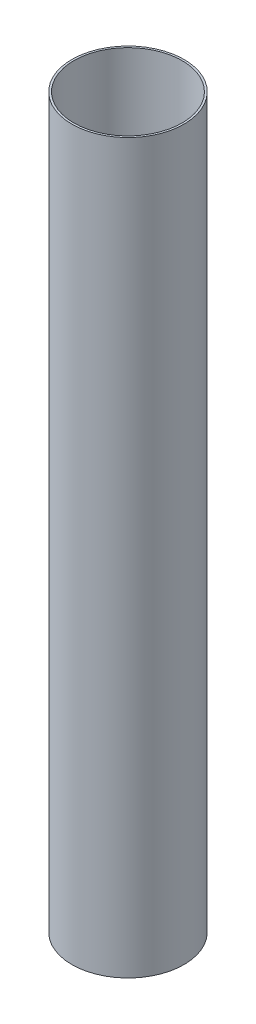
ISO-10303-21;
HEADER;
FILE_DESCRIPTION(('STEP AP214'),'2;1');
FILE_NAME('part.step','',(''),(''),'','','');
FILE_SCHEMA(('AUTOMOTIVE_DESIGN { 1 0 10303 214 1 1 1 1 }'));
ENDSEC;
DATA;
#1=APPLICATION_CONTEXT('core data for automotive mechanical design processes');
#2=APPLICATION_PROTOCOL_DEFINITION('international standard','automotive_design',2000,#1);
#3=PRODUCT_CONTEXT('',#1,'mechanical');
#4=PRODUCT('Part','Part','',(#3));
#5=PRODUCT_RELATED_PRODUCT_CATEGORY('part','',(#4));
#6=PRODUCT_DEFINITION_FORMATION('','',#4);
#7=PRODUCT_DEFINITION_CONTEXT('part definition',#1,'design');
#8=PRODUCT_DEFINITION('design','',#6,#7);
#9=PRODUCT_DEFINITION_SHAPE('','',#8);
#10=(LENGTH_UNIT() NAMED_UNIT(*) SI_UNIT(.MILLI.,.METRE.));
#11=(NAMED_UNIT(*) PLANE_ANGLE_UNIT() SI_UNIT($,.RADIAN.));
#12=(NAMED_UNIT(*) SI_UNIT($,.STERADIAN.) SOLID_ANGLE_UNIT());
#13=UNCERTAINTY_MEASURE_WITH_UNIT(LENGTH_MEASURE(1.E-05),#10,'distance_accuracy_value','');
#14=(GEOMETRIC_REPRESENTATION_CONTEXT(3) GLOBAL_UNCERTAINTY_ASSIGNED_CONTEXT((#13)) GLOBAL_UNIT_ASSIGNED_CONTEXT((#10,
#11,#12)) REPRESENTATION_CONTEXT('',''));
#15=CARTESIAN_POINT('',(0.,0.,0.));
#16=DIRECTION('',(0.,0.,1.));
#17=DIRECTION('',(1.,0.,0.));
#18=AXIS2_PLACEMENT_3D('',#15,#16,#17);
#19=CARTESIAN_POINT('',(0.,370.,0.));
#20=DIRECTION('',(0.,1.,0.));
#21=DIRECTION('',(0.,0.,1.));
#22=AXIS2_PLACEMENT_3D('',#19,#20,#21);
#23=PLANE('',#22);
#24=CARTESIAN_POINT('',(0.,370.,0.));
#25=DIRECTION('',(0.,1.,0.));
#26=DIRECTION('',(0.,0.,1.));
#27=AXIS2_PLACEMENT_3D('',#24,#25,#26);
#28=CIRCLE('',#27,28.5);
#29=CARTESIAN_POINT('',(0.,370.,28.5));
#30=VERTEX_POINT('',#29);
#31=EDGE_CURVE('E10',#30,#30,#28,.T.);
#32=ORIENTED_EDGE('',*,*,#31,.T.);
#33=EDGE_LOOP('',(#32));
#34=FACE_BOUND('',#33,.T.);
#35=CARTESIAN_POINT('',(0.,370.,0.));
#36=DIRECTION('',(0.,1.,0.));
#37=DIRECTION('',(0.,0.,1.));
#38=AXIS2_PLACEMENT_3D('',#35,#36,#37);
#39=CIRCLE('',#38,27.5);
#40=CARTESIAN_POINT('',(0.,370.,27.5));
#41=VERTEX_POINT('',#40);
#42=EDGE_CURVE('E45',#41,#41,#39,.T.);
#43=ORIENTED_EDGE('',*,*,#42,.F.);
#44=EDGE_LOOP('',(#43));
#45=FACE_BOUND('',#44,.T.);
#46=ADVANCED_FACE('F34',(#34,#45),#23,.T.);
#47=CARTESIAN_POINT('',(0.,0.,0.));
#48=DIRECTION('',(0.,1.,0.));
#49=DIRECTION('',(0.,0.,1.));
#50=AXIS2_PLACEMENT_3D('',#47,#48,#49);
#51=PLANE('',#50);
#52=CARTESIAN_POINT('',(0.,0.,0.));
#53=DIRECTION('',(0.,1.,0.));
#54=DIRECTION('',(0.,0.,1.));
#55=AXIS2_PLACEMENT_3D('',#52,#53,#54);
#56=CIRCLE('',#55,28.5);
#57=CARTESIAN_POINT('',(0.,0.,28.5));
#58=VERTEX_POINT('',#57);
#59=EDGE_CURVE('E38',#58,#58,#56,.T.);
#60=ORIENTED_EDGE('',*,*,#59,.F.);
#61=EDGE_LOOP('',(#60));
#62=FACE_BOUND('',#61,.T.);
#63=CARTESIAN_POINT('',(0.,0.,0.));
#64=DIRECTION('',(0.,1.,0.));
#65=DIRECTION('',(0.,0.,1.));
#66=AXIS2_PLACEMENT_3D('',#63,#64,#65);
#67=CIRCLE('',#66,27.5);
#68=CARTESIAN_POINT('',(0.,0.,27.5));
#69=VERTEX_POINT('',#68);
#70=EDGE_CURVE('E47',#69,#69,#67,.T.);
#71=ORIENTED_EDGE('',*,*,#70,.T.);
#72=EDGE_LOOP('',(#71));
#73=FACE_BOUND('',#72,.T.);
#74=ADVANCED_FACE('F57',(#62,#73),#51,.F.);
#75=CARTESIAN_POINT('',(0.,370.,0.));
#76=DIRECTION('',(0.,-1.,0.));
#77=DIRECTION('',(0.,0.,-1.));
#78=AXIS2_PLACEMENT_3D('',#75,#76,#77);
#79=CYLINDRICAL_SURFACE('',#78,28.5);
#80=ORIENTED_EDGE('',*,*,#31,.F.);
#81=EDGE_LOOP('',(#80));
#82=FACE_BOUND('',#81,.T.);
#83=ORIENTED_EDGE('',*,*,#59,.T.);
#84=EDGE_LOOP('',(#83));
#85=FACE_BOUND('',#84,.T.);
#86=ADVANCED_FACE('F36',(#82,#85),#79,.T.);
#87=CARTESIAN_POINT('',(0.,370.,0.));
#88=DIRECTION('',(0.,-1.,0.));
#89=DIRECTION('',(0.,0.,-1.));
#90=AXIS2_PLACEMENT_3D('',#87,#88,#89);
#91=CYLINDRICAL_SURFACE('',#90,27.5);
#92=ORIENTED_EDGE('',*,*,#42,.T.);
#93=EDGE_LOOP('',(#92));
#94=FACE_BOUND('',#93,.T.);
#95=ORIENTED_EDGE('',*,*,#70,.F.);
#96=EDGE_LOOP('',(#95));
#97=FACE_BOUND('',#96,.T.);
#98=ADVANCED_FACE('F53',(#94,#97),#91,.F.);
#99=CLOSED_SHELL('',(#46,#74,#86,#98));
#100=MANIFOLD_SOLID_BREP('B2',#99);
#101=ADVANCED_BREP_SHAPE_REPRESENTATION('',(#18,#100),#14);
#102=SHAPE_DEFINITION_REPRESENTATION(#9,#101);
ENDSEC;
END-ISO-10303-21;
